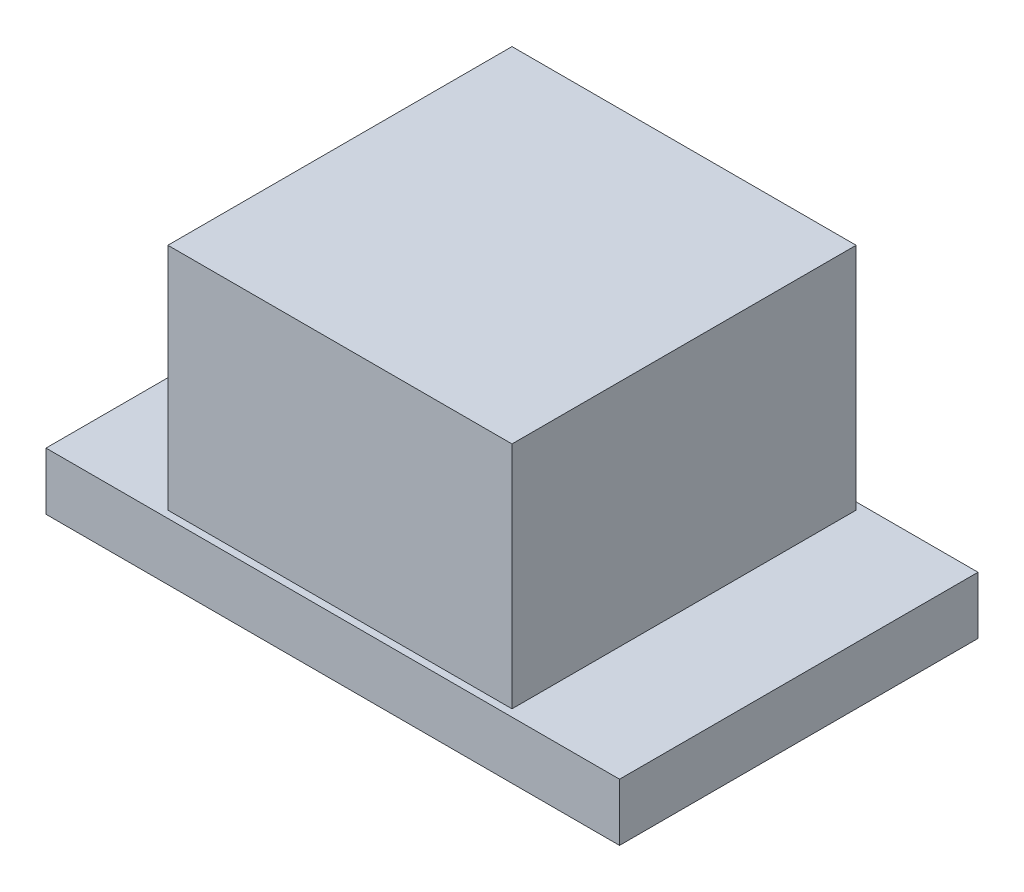
ISO-10303-21;
HEADER;
FILE_DESCRIPTION(('STEP AP214'),'2;1');
FILE_NAME('part.step','',(''),(''),'','','');
FILE_SCHEMA(('AUTOMOTIVE_DESIGN { 1 0 10303 214 1 1 1 1 }'));
ENDSEC;
DATA;
#1=APPLICATION_CONTEXT('core data for automotive mechanical design processes');
#2=APPLICATION_PROTOCOL_DEFINITION('international standard','automotive_design',2000,#1);
#3=PRODUCT_CONTEXT('',#1,'mechanical');
#4=PRODUCT('Part','Part','',(#3));
#5=PRODUCT_RELATED_PRODUCT_CATEGORY('part','',(#4));
#6=PRODUCT_DEFINITION_FORMATION('','',#4);
#7=PRODUCT_DEFINITION_CONTEXT('part definition',#1,'design');
#8=PRODUCT_DEFINITION('design','',#6,#7);
#9=PRODUCT_DEFINITION_SHAPE('','',#8);
#10=(LENGTH_UNIT() NAMED_UNIT(*) SI_UNIT(.MILLI.,.METRE.));
#11=(NAMED_UNIT(*) PLANE_ANGLE_UNIT() SI_UNIT($,.RADIAN.));
#12=(NAMED_UNIT(*) SI_UNIT($,.STERADIAN.) SOLID_ANGLE_UNIT());
#13=UNCERTAINTY_MEASURE_WITH_UNIT(LENGTH_MEASURE(1.E-05),#10,'distance_accuracy_value','');
#14=(GEOMETRIC_REPRESENTATION_CONTEXT(3) GLOBAL_UNCERTAINTY_ASSIGNED_CONTEXT((#13)) GLOBAL_UNIT_ASSIGNED_CONTEXT((#10,
#11,#12)) REPRESENTATION_CONTEXT('',''));
#15=CARTESIAN_POINT('',(0.,0.,0.));
#16=DIRECTION('',(0.,0.,1.));
#17=DIRECTION('',(1.,0.,0.));
#18=AXIS2_PLACEMENT_3D('',#15,#16,#17);
#19=CARTESIAN_POINT('',(-0.6,1.,-0.6));
#20=DIRECTION('',(1.,0.,0.));
#21=DIRECTION('',(0.,0.,-1.));
#22=AXIS2_PLACEMENT_3D('',#19,#20,#21);
#23=PLANE('',#22);
#24=DIRECTION('',(0.,0.,1.));
#25=VECTOR('',#24,1.);
#26=CARTESIAN_POINT('',(-0.6,0.2,-0.6));
#27=LINE('',#26,#25);
#28=CARTESIAN_POINT('',(-0.6,0.2,-0.6));
#29=VERTEX_POINT('',#28);
#30=CARTESIAN_POINT('',(-0.6,0.2,0.6));
#31=VERTEX_POINT('',#30);
#32=EDGE_CURVE('E106',#29,#31,#27,.T.);
#33=ORIENTED_EDGE('',*,*,#32,.T.);
#34=DIRECTION('',(0.,-1.,0.));
#35=VECTOR('',#34,1.);
#36=CARTESIAN_POINT('',(-0.6,1.,0.6));
#37=LINE('',#36,#35);
#38=CARTESIAN_POINT('',(-0.6,1.,0.6));
#39=VERTEX_POINT('',#38);
#40=EDGE_CURVE('E12',#39,#31,#37,.T.);
#41=ORIENTED_EDGE('',*,*,#40,.F.);
#42=DIRECTION('',(0.,0.,1.));
#43=VECTOR('',#42,1.);
#44=CARTESIAN_POINT('',(-0.6,1.,-0.6));
#45=LINE('',#44,#43);
#46=CARTESIAN_POINT('',(-0.6,1.,-0.6));
#47=VERTEX_POINT('',#46);
#48=EDGE_CURVE('E94',#47,#39,#45,.T.);
#49=ORIENTED_EDGE('',*,*,#48,.F.);
#50=DIRECTION('',(0.,-1.,0.));
#51=VECTOR('',#50,1.);
#52=CARTESIAN_POINT('',(-0.6,1.,-0.6));
#53=LINE('',#52,#51);
#54=EDGE_CURVE('E102',#47,#29,#53,.T.);
#55=ORIENTED_EDGE('',*,*,#54,.T.);
#56=EDGE_LOOP('',(#33,#41,#49,#55));
#57=FACE_BOUND('',#56,.T.);
#58=ADVANCED_FACE('F43',(#57),#23,.F.);
#59=CARTESIAN_POINT('',(-0.6,1.,0.6));
#60=DIRECTION('',(0.,0.,-1.));
#61=DIRECTION('',(-1.,0.,0.));
#62=AXIS2_PLACEMENT_3D('',#59,#60,#61);
#63=PLANE('',#62);
#64=DIRECTION('',(1.,0.,0.));
#65=VECTOR('',#64,1.);
#66=CARTESIAN_POINT('',(-0.6,0.2,0.6));
#67=LINE('',#66,#65);
#68=CARTESIAN_POINT('',(0.6,0.2,0.6));
#69=VERTEX_POINT('',#68);
#70=EDGE_CURVE('E98',#31,#69,#67,.T.);
#71=ORIENTED_EDGE('',*,*,#70,.T.);
#72=DIRECTION('',(0.,-1.,0.));
#73=VECTOR('',#72,1.);
#74=CARTESIAN_POINT('',(0.6,1.,0.6));
#75=LINE('',#74,#73);
#76=CARTESIAN_POINT('',(0.6,1.,0.6));
#77=VERTEX_POINT('',#76);
#78=EDGE_CURVE('E51',#77,#69,#75,.T.);
#79=ORIENTED_EDGE('',*,*,#78,.F.);
#80=DIRECTION('',(1.,0.,0.));
#81=VECTOR('',#80,1.);
#82=CARTESIAN_POINT('',(-0.6,1.,0.6));
#83=LINE('',#82,#81);
#84=EDGE_CURVE('E89',#39,#77,#83,.T.);
#85=ORIENTED_EDGE('',*,*,#84,.F.);
#86=ORIENTED_EDGE('',*,*,#40,.T.);
#87=EDGE_LOOP('',(#71,#79,#85,#86));
#88=FACE_BOUND('',#87,.T.);
#89=ADVANCED_FACE('F97',(#88),#63,.F.);
#90=CARTESIAN_POINT('',(0.6,1.,0.6));
#91=DIRECTION('',(-1.,0.,0.));
#92=DIRECTION('',(0.,0.,1.));
#93=AXIS2_PLACEMENT_3D('',#90,#91,#92);
#94=PLANE('',#93);
#95=DIRECTION('',(0.,0.,-1.));
#96=VECTOR('',#95,1.);
#97=CARTESIAN_POINT('',(0.6,0.2,0.6));
#98=LINE('',#97,#96);
#99=CARTESIAN_POINT('',(0.6,0.2,-0.6));
#100=VERTEX_POINT('',#99);
#101=EDGE_CURVE('E76',#69,#100,#98,.T.);
#102=ORIENTED_EDGE('',*,*,#101,.T.);
#103=DIRECTION('',(0.,-1.,0.));
#104=VECTOR('',#103,1.);
#105=CARTESIAN_POINT('',(0.6,1.,-0.6));
#106=LINE('',#105,#104);
#107=CARTESIAN_POINT('',(0.6,1.,-0.6));
#108=VERTEX_POINT('',#107);
#109=EDGE_CURVE('E99',#108,#100,#106,.T.);
#110=ORIENTED_EDGE('',*,*,#109,.F.);
#111=DIRECTION('',(0.,0.,-1.));
#112=VECTOR('',#111,1.);
#113=CARTESIAN_POINT('',(0.6,1.,0.6));
#114=LINE('',#113,#112);
#115=EDGE_CURVE('E92',#77,#108,#114,.T.);
#116=ORIENTED_EDGE('',*,*,#115,.F.);
#117=ORIENTED_EDGE('',*,*,#78,.T.);
#118=EDGE_LOOP('',(#102,#110,#116,#117));
#119=FACE_BOUND('',#118,.T.);
#120=ADVANCED_FACE('F100',(#119),#94,.F.);
#121=CARTESIAN_POINT('',(0.6,1.,-0.6));
#122=DIRECTION('',(0.,0.,1.));
#123=DIRECTION('',(1.,0.,0.));
#124=AXIS2_PLACEMENT_3D('',#121,#122,#123);
#125=PLANE('',#124);
#126=DIRECTION('',(-1.,0.,0.));
#127=VECTOR('',#126,1.);
#128=CARTESIAN_POINT('',(0.6,0.2,-0.6));
#129=LINE('',#128,#127);
#130=EDGE_CURVE('E82',#100,#29,#129,.T.);
#131=ORIENTED_EDGE('',*,*,#130,.T.);
#132=ORIENTED_EDGE('',*,*,#54,.F.);
#133=DIRECTION('',(-1.,0.,0.));
#134=VECTOR('',#133,1.);
#135=CARTESIAN_POINT('',(0.6,1.,-0.6));
#136=LINE('',#135,#134);
#137=EDGE_CURVE('E59',#108,#47,#136,.T.);
#138=ORIENTED_EDGE('',*,*,#137,.F.);
#139=ORIENTED_EDGE('',*,*,#109,.T.);
#140=EDGE_LOOP('',(#131,#132,#138,#139));
#141=FACE_BOUND('',#140,.T.);
#142=ADVANCED_FACE('F113',(#141),#125,.F.);
#143=CARTESIAN_POINT('',(0.,1.,0.));
#144=DIRECTION('',(0.,1.,0.));
#145=DIRECTION('',(0.,0.,1.));
#146=AXIS2_PLACEMENT_3D('',#143,#144,#145);
#147=PLANE('',#146);
#148=ORIENTED_EDGE('',*,*,#48,.T.);
#149=ORIENTED_EDGE('',*,*,#84,.T.);
#150=ORIENTED_EDGE('',*,*,#115,.T.);
#151=ORIENTED_EDGE('',*,*,#137,.T.);
#152=EDGE_LOOP('',(#148,#149,#150,#151));
#153=FACE_BOUND('',#152,.T.);
#154=ADVANCED_FACE('F90',(#153),#147,.T.);
#155=CARTESIAN_POINT('',(0.,0.2,0.));
#156=DIRECTION('',(0.,1.,0.));
#157=DIRECTION('',(0.,0.,1.));
#158=AXIS2_PLACEMENT_3D('',#155,#156,#157);
#159=PLANE('',#158);
#160=ORIENTED_EDGE('',*,*,#32,.F.);
#161=ORIENTED_EDGE('',*,*,#130,.F.);
#162=ORIENTED_EDGE('',*,*,#101,.F.);
#163=ORIENTED_EDGE('',*,*,#70,.F.);
#164=EDGE_LOOP('',(#160,#161,#162,#163));
#165=FACE_BOUND('',#164,.T.);
#166=ADVANCED_FACE('F116',(#165),#159,.F.);
#167=CLOSED_SHELL('',(#58,#89,#120,#142,#154,#166));
#168=MANIFOLD_SOLID_BREP('B2',#167);
#169=CARTESIAN_POINT('',(-0.6,0.2,0.6));
#170=DIRECTION('',(0.,0.,-1.));
#171=DIRECTION('',(-1.,0.,0.));
#172=AXIS2_PLACEMENT_3D('',#169,#170,#171);
#173=PLANE('',#172);
#174=DIRECTION('',(1.,0.,0.));
#175=VECTOR('',#174,1.);
#176=CARTESIAN_POINT('',(-0.6,0.19,0.6));
#177=LINE('',#176,#175);
#178=CARTESIAN_POINT('',(-0.6,0.19,0.6));
#179=VERTEX_POINT('',#178);
#180=CARTESIAN_POINT('',(0.6,0.19,0.6));
#181=VERTEX_POINT('',#180);
#182=EDGE_CURVE('E239',#179,#181,#177,.T.);
#183=ORIENTED_EDGE('',*,*,#182,.T.);
#184=DIRECTION('',(0.,-1.,0.));
#185=VECTOR('',#184,1.);
#186=CARTESIAN_POINT('',(0.6,0.2,0.6));
#187=LINE('',#186,#185);
#188=CARTESIAN_POINT('',(0.6,0.2,0.6));
#189=VERTEX_POINT('',#188);
#190=EDGE_CURVE('E41',#189,#181,#187,.T.);
#191=ORIENTED_EDGE('',*,*,#190,.F.);
#192=DIRECTION('',(1.,0.,0.));
#193=VECTOR('',#192,1.);
#194=CARTESIAN_POINT('',(-0.6,0.2,0.6));
#195=LINE('',#194,#193);
#196=CARTESIAN_POINT('',(-0.6,0.2,0.6));
#197=VERTEX_POINT('',#196);
#198=EDGE_CURVE('E227',#197,#189,#195,.T.);
#199=ORIENTED_EDGE('',*,*,#198,.F.);
#200=DIRECTION('',(0.,-1.,0.));
#201=VECTOR('',#200,1.);
#202=CARTESIAN_POINT('',(-0.6,0.2,0.6));
#203=LINE('',#202,#201);
#204=EDGE_CURVE('E235',#197,#179,#203,.T.);
#205=ORIENTED_EDGE('',*,*,#204,.T.);
#206=EDGE_LOOP('',(#183,#191,#199,#205));
#207=FACE_BOUND('',#206,.T.);
#208=ADVANCED_FACE('F176',(#207),#173,.F.);
#209=CARTESIAN_POINT('',(0.6,0.2,0.6));
#210=DIRECTION('',(-1.,0.,0.));
#211=DIRECTION('',(0.,0.,1.));
#212=AXIS2_PLACEMENT_3D('',#209,#210,#211);
#213=PLANE('',#212);
#214=DIRECTION('',(0.,0.,-1.));
#215=VECTOR('',#214,1.);
#216=CARTESIAN_POINT('',(0.6,0.19,0.6));
#217=LINE('',#216,#215);
#218=CARTESIAN_POINT('',(0.6,0.19,-0.6));
#219=VERTEX_POINT('',#218);
#220=EDGE_CURVE('E231',#181,#219,#217,.T.);
#221=ORIENTED_EDGE('',*,*,#220,.T.);
#222=DIRECTION('',(0.,-1.,0.));
#223=VECTOR('',#222,1.);
#224=CARTESIAN_POINT('',(0.6,0.2,-0.6));
#225=LINE('',#224,#223);
#226=CARTESIAN_POINT('',(0.6,0.2,-0.6));
#227=VERTEX_POINT('',#226);
#228=EDGE_CURVE('E184',#227,#219,#225,.T.);
#229=ORIENTED_EDGE('',*,*,#228,.F.);
#230=DIRECTION('',(0.,0.,-1.));
#231=VECTOR('',#230,1.);
#232=CARTESIAN_POINT('',(0.6,0.2,0.6));
#233=LINE('',#232,#231);
#234=EDGE_CURVE('E222',#189,#227,#233,.T.);
#235=ORIENTED_EDGE('',*,*,#234,.F.);
#236=ORIENTED_EDGE('',*,*,#190,.T.);
#237=EDGE_LOOP('',(#221,#229,#235,#236));
#238=FACE_BOUND('',#237,.T.);
#239=ADVANCED_FACE('F230',(#238),#213,.F.);
#240=CARTESIAN_POINT('',(0.6,0.2,-0.6));
#241=DIRECTION('',(0.,0.,1.));
#242=DIRECTION('',(1.,0.,0.));
#243=AXIS2_PLACEMENT_3D('',#240,#241,#242);
#244=PLANE('',#243);
#245=DIRECTION('',(-1.,0.,0.));
#246=VECTOR('',#245,1.);
#247=CARTESIAN_POINT('',(0.6,0.19,-0.6));
#248=LINE('',#247,#246);
#249=CARTESIAN_POINT('',(-0.6,0.19,-0.6));
#250=VERTEX_POINT('',#249);
#251=EDGE_CURVE('E209',#219,#250,#248,.T.);
#252=ORIENTED_EDGE('',*,*,#251,.T.);
#253=DIRECTION('',(0.,-1.,0.));
#254=VECTOR('',#253,1.);
#255=CARTESIAN_POINT('',(-0.6,0.2,-0.6));
#256=LINE('',#255,#254);
#257=CARTESIAN_POINT('',(-0.6,0.2,-0.6));
#258=VERTEX_POINT('',#257);
#259=EDGE_CURVE('E232',#258,#250,#256,.T.);
#260=ORIENTED_EDGE('',*,*,#259,.F.);
#261=DIRECTION('',(-1.,0.,0.));
#262=VECTOR('',#261,1.);
#263=CARTESIAN_POINT('',(0.6,0.2,-0.6));
#264=LINE('',#263,#262);
#265=EDGE_CURVE('E225',#227,#258,#264,.T.);
#266=ORIENTED_EDGE('',*,*,#265,.F.);
#267=ORIENTED_EDGE('',*,*,#228,.T.);
#268=EDGE_LOOP('',(#252,#260,#266,#267));
#269=FACE_BOUND('',#268,.T.);
#270=ADVANCED_FACE('F233',(#269),#244,.F.);
#271=CARTESIAN_POINT('',(-0.6,0.2,-0.6));
#272=DIRECTION('',(1.,0.,0.));
#273=DIRECTION('',(0.,0.,-1.));
#274=AXIS2_PLACEMENT_3D('',#271,#272,#273);
#275=PLANE('',#274);
#276=DIRECTION('',(0.,0.,1.));
#277=VECTOR('',#276,1.);
#278=CARTESIAN_POINT('',(-0.6,0.19,-0.6));
#279=LINE('',#278,#277);
#280=EDGE_CURVE('E215',#250,#179,#279,.T.);
#281=ORIENTED_EDGE('',*,*,#280,.T.);
#282=ORIENTED_EDGE('',*,*,#204,.F.);
#283=DIRECTION('',(0.,0.,1.));
#284=VECTOR('',#283,1.);
#285=CARTESIAN_POINT('',(-0.6,0.2,-0.6));
#286=LINE('',#285,#284);
#287=EDGE_CURVE('E192',#258,#197,#286,.T.);
#288=ORIENTED_EDGE('',*,*,#287,.F.);
#289=ORIENTED_EDGE('',*,*,#259,.T.);
#290=EDGE_LOOP('',(#281,#282,#288,#289));
#291=FACE_BOUND('',#290,.T.);
#292=ADVANCED_FACE('F246',(#291),#275,.F.);
#293=CARTESIAN_POINT('',(0.,0.2,0.));
#294=DIRECTION('',(0.,1.,0.));
#295=DIRECTION('',(0.,0.,1.));
#296=AXIS2_PLACEMENT_3D('',#293,#294,#295);
#297=PLANE('',#296);
#298=ORIENTED_EDGE('',*,*,#198,.T.);
#299=ORIENTED_EDGE('',*,*,#234,.T.);
#300=ORIENTED_EDGE('',*,*,#265,.T.);
#301=ORIENTED_EDGE('',*,*,#287,.T.);
#302=EDGE_LOOP('',(#298,#299,#300,#301));
#303=FACE_BOUND('',#302,.T.);
#304=ADVANCED_FACE('F223',(#303),#297,.T.);
#305=CARTESIAN_POINT('',(0.,0.19,0.));
#306=DIRECTION('',(0.,1.,0.));
#307=DIRECTION('',(0.,0.,1.));
#308=AXIS2_PLACEMENT_3D('',#305,#306,#307);
#309=PLANE('',#308);
#310=ORIENTED_EDGE('',*,*,#182,.F.);
#311=ORIENTED_EDGE('',*,*,#280,.F.);
#312=ORIENTED_EDGE('',*,*,#251,.F.);
#313=ORIENTED_EDGE('',*,*,#220,.F.);
#314=EDGE_LOOP('',(#310,#311,#312,#313));
#315=FACE_BOUND('',#314,.T.);
#316=ADVANCED_FACE('F249',(#315),#309,.F.);
#317=CLOSED_SHELL('',(#208,#239,#270,#292,#304,#316));
#318=MANIFOLD_SOLID_BREP('B6',#317);
#319=CARTESIAN_POINT('',(0.,0.2,0.));
#320=DIRECTION('',(0.,1.,0.));
#321=DIRECTION('',(0.,0.,1.));
#322=AXIS2_PLACEMENT_3D('',#319,#320,#321);
#323=PLANE('',#322);
#324=DIRECTION('',(0.,0.,-1.));
#325=VECTOR('',#324,1.);
#326=CARTESIAN_POINT('',(0.6,0.2,-0.6));
#327=LINE('',#326,#325);
#328=CARTESIAN_POINT('',(0.6,0.2,0.6));
#329=VERTEX_POINT('',#328);
#330=CARTESIAN_POINT('',(0.6,0.2,-0.6));
#331=VERTEX_POINT('',#330);
#332=EDGE_CURVE('E316',#329,#331,#327,.T.);
#333=ORIENTED_EDGE('',*,*,#332,.F.);
#334=DIRECTION('',(1.,0.,0.));
#335=VECTOR('',#334,1.);
#336=CARTESIAN_POINT('',(-0.6,0.2,0.6));
#337=LINE('',#336,#335);
#338=CARTESIAN_POINT('',(-0.6,0.2,0.6));
#339=VERTEX_POINT('',#338);
#340=EDGE_CURVE('E409',#339,#329,#337,.T.);
#341=ORIENTED_EDGE('',*,*,#340,.F.);
#342=DIRECTION('',(0.,0.,1.));
#343=VECTOR('',#342,1.);
#344=CARTESIAN_POINT('',(-0.6,0.2,-0.6));
#345=LINE('',#344,#343);
#346=CARTESIAN_POINT('',(-0.6,0.2,-0.6));
#347=VERTEX_POINT('',#346);
#348=EDGE_CURVE('E406',#347,#339,#345,.T.);
#349=ORIENTED_EDGE('',*,*,#348,.F.);
#350=DIRECTION('',(-1.,0.,0.));
#351=VECTOR('',#350,1.);
#352=CARTESIAN_POINT('',(-0.6,0.2,-0.6));
#353=LINE('',#352,#351);
#354=EDGE_CURVE('E407',#331,#347,#353,.T.);
#355=ORIENTED_EDGE('',*,*,#354,.F.);
#356=EDGE_LOOP('',(#333,#341,#349,#355));
#357=FACE_BOUND('',#356,.T.);
#358=DIRECTION('',(0.,0.,-1.));
#359=VECTOR('',#358,1.);
#360=CARTESIAN_POINT('',(1.,0.2,-0.625));
#361=LINE('',#360,#359);
#362=CARTESIAN_POINT('',(1.,0.2,0.625));
#363=VERTEX_POINT('',#362);
#364=CARTESIAN_POINT('',(1.,0.2,-0.625));
#365=VERTEX_POINT('',#364);
#366=EDGE_CURVE('E380',#363,#365,#361,.T.);
#367=ORIENTED_EDGE('',*,*,#366,.T.);
#368=DIRECTION('',(-1.,0.,0.));
#369=VECTOR('',#368,1.);
#370=CARTESIAN_POINT('',(-1.,0.2,-0.625));
#371=LINE('',#370,#369);
#372=CARTESIAN_POINT('',(-1.,0.2,-0.625));
#373=VERTEX_POINT('',#372);
#374=EDGE_CURVE('E374',#365,#373,#371,.T.);
#375=ORIENTED_EDGE('',*,*,#374,.T.);
#376=DIRECTION('',(0.,0.,1.));
#377=VECTOR('',#376,1.);
#378=CARTESIAN_POINT('',(-1.,0.2,-0.625));
#379=LINE('',#378,#377);
#380=CARTESIAN_POINT('',(-1.,0.2,0.625));
#381=VERTEX_POINT('',#380);
#382=EDGE_CURVE('E377',#373,#381,#379,.T.);
#383=ORIENTED_EDGE('',*,*,#382,.T.);
#384=DIRECTION('',(1.,0.,0.));
#385=VECTOR('',#384,1.);
#386=CARTESIAN_POINT('',(-1.,0.2,0.625));
#387=LINE('',#386,#385);
#388=EDGE_CURVE('E396',#381,#363,#387,.T.);
#389=ORIENTED_EDGE('',*,*,#388,.T.);
#390=EDGE_LOOP('',(#367,#375,#383,#389));
#391=FACE_BOUND('',#390,.T.);
#392=ADVANCED_FACE('F306',(#357,#391),#323,.T.);
#393=CARTESIAN_POINT('',(1.,0.2,-0.625));
#394=DIRECTION('',(-1.,0.,0.));
#395=DIRECTION('',(0.,0.,1.));
#396=AXIS2_PLACEMENT_3D('',#393,#394,#395);
#397=PLANE('',#396);
#398=DIRECTION('',(0.,0.,-1.));
#399=VECTOR('',#398,1.);
#400=CARTESIAN_POINT('',(1.,0.,-0.625));
#401=LINE('',#400,#399);
#402=CARTESIAN_POINT('',(1.,0.,0.625));
#403=VERTEX_POINT('',#402);
#404=CARTESIAN_POINT('',(1.,0.,-0.625));
#405=VERTEX_POINT('',#404);
#406=EDGE_CURVE('E398',#403,#405,#401,.T.);
#407=ORIENTED_EDGE('',*,*,#406,.T.);
#408=DIRECTION('',(0.,-1.,0.));
#409=VECTOR('',#408,1.);
#410=CARTESIAN_POINT('',(1.,0.2,-0.625));
#411=LINE('',#410,#409);
#412=EDGE_CURVE('E436',#365,#405,#411,.T.);
#413=ORIENTED_EDGE('',*,*,#412,.F.);
#414=ORIENTED_EDGE('',*,*,#366,.F.);
#415=DIRECTION('',(0.,-1.,0.));
#416=VECTOR('',#415,1.);
#417=CARTESIAN_POINT('',(1.,0.2,0.625));
#418=LINE('',#417,#416);
#419=EDGE_CURVE('E432',#363,#403,#418,.T.);
#420=ORIENTED_EDGE('',*,*,#419,.T.);
#421=EDGE_LOOP('',(#407,#413,#414,#420));
#422=FACE_BOUND('',#421,.T.);
#423=ADVANCED_FACE('F439',(#422),#397,.F.);
#424=CARTESIAN_POINT('',(-1.,0.2,-0.625));
#425=DIRECTION('',(0.,0.,1.));
#426=DIRECTION('',(1.,0.,0.));
#427=AXIS2_PLACEMENT_3D('',#424,#425,#426);
#428=PLANE('',#427);
#429=DIRECTION('',(-1.,0.,0.));
#430=VECTOR('',#429,1.);
#431=CARTESIAN_POINT('',(-1.,0.,-0.625));
#432=LINE('',#431,#430);
#433=CARTESIAN_POINT('',(-1.,0.,-0.625));
#434=VERTEX_POINT('',#433);
#435=EDGE_CURVE('E355',#405,#434,#432,.T.);
#436=ORIENTED_EDGE('',*,*,#435,.T.);
#437=DIRECTION('',(0.,-1.,0.));
#438=VECTOR('',#437,1.);
#439=CARTESIAN_POINT('',(-1.,0.2,-0.625));
#440=LINE('',#439,#438);
#441=EDGE_CURVE('E385',#373,#434,#440,.T.);
#442=ORIENTED_EDGE('',*,*,#441,.F.);
#443=ORIENTED_EDGE('',*,*,#374,.F.);
#444=ORIENTED_EDGE('',*,*,#412,.T.);
#445=EDGE_LOOP('',(#436,#442,#443,#444));
#446=FACE_BOUND('',#445,.T.);
#447=ADVANCED_FACE('F386',(#446),#428,.F.);
#448=CARTESIAN_POINT('',(-1.,0.2,-0.625));
#449=DIRECTION('',(1.,0.,0.));
#450=DIRECTION('',(0.,0.,-1.));
#451=AXIS2_PLACEMENT_3D('',#448,#449,#450);
#452=PLANE('',#451);
#453=DIRECTION('',(0.,0.,1.));
#454=VECTOR('',#453,1.);
#455=CARTESIAN_POINT('',(-1.,0.,-0.625));
#456=LINE('',#455,#454);
#457=CARTESIAN_POINT('',(-1.,0.,0.625));
#458=VERTEX_POINT('',#457);
#459=EDGE_CURVE('E390',#434,#458,#456,.T.);
#460=ORIENTED_EDGE('',*,*,#459,.T.);
#461=DIRECTION('',(0.,-1.,0.));
#462=VECTOR('',#461,1.);
#463=CARTESIAN_POINT('',(-1.,0.2,0.625));
#464=LINE('',#463,#462);
#465=EDGE_CURVE('E394',#381,#458,#464,.T.);
#466=ORIENTED_EDGE('',*,*,#465,.F.);
#467=ORIENTED_EDGE('',*,*,#382,.F.);
#468=ORIENTED_EDGE('',*,*,#441,.T.);
#469=EDGE_LOOP('',(#460,#466,#467,#468));
#470=FACE_BOUND('',#469,.T.);
#471=ADVANCED_FACE('F392',(#470),#452,.F.);
#472=CARTESIAN_POINT('',(-1.,0.2,0.625));
#473=DIRECTION('',(0.,0.,-1.));
#474=DIRECTION('',(-1.,0.,0.));
#475=AXIS2_PLACEMENT_3D('',#472,#473,#474);
#476=PLANE('',#475);
#477=DIRECTION('',(1.,0.,0.));
#478=VECTOR('',#477,1.);
#479=CARTESIAN_POINT('',(-1.,0.,0.625));
#480=LINE('',#479,#478);
#481=EDGE_CURVE('E389',#458,#403,#480,.T.);
#482=ORIENTED_EDGE('',*,*,#481,.T.);
#483=ORIENTED_EDGE('',*,*,#419,.F.);
#484=ORIENTED_EDGE('',*,*,#388,.F.);
#485=ORIENTED_EDGE('',*,*,#465,.T.);
#486=EDGE_LOOP('',(#482,#483,#484,#485));
#487=FACE_BOUND('',#486,.T.);
#488=ADVANCED_FACE('F442',(#487),#476,.F.);
#489=CARTESIAN_POINT('',(0.,0.,0.));
#490=DIRECTION('',(0.,1.,0.));
#491=DIRECTION('',(0.,0.,1.));
#492=AXIS2_PLACEMENT_3D('',#489,#490,#491);
#493=PLANE('',#492);
#494=ORIENTED_EDGE('',*,*,#406,.F.);
#495=ORIENTED_EDGE('',*,*,#481,.F.);
#496=ORIENTED_EDGE('',*,*,#459,.F.);
#497=ORIENTED_EDGE('',*,*,#435,.F.);
#498=EDGE_LOOP('',(#494,#495,#496,#497));
#499=FACE_BOUND('',#498,.T.);
#500=ADVANCED_FACE('F441',(#499),#493,.F.);
#501=CARTESIAN_POINT('',(0.,0.19,0.));
#502=DIRECTION('',(0.,1.,0.));
#503=DIRECTION('',(0.,0.,1.));
#504=AXIS2_PLACEMENT_3D('',#501,#502,#503);
#505=PLANE('',#504);
#506=DIRECTION('',(0.,0.,-1.));
#507=VECTOR('',#506,1.);
#508=CARTESIAN_POINT('',(0.6,0.19,-0.6));
#509=LINE('',#508,#507);
#510=CARTESIAN_POINT('',(0.6,0.19,0.6));
#511=VERTEX_POINT('',#510);
#512=CARTESIAN_POINT('',(0.6,0.19,-0.6));
#513=VERTEX_POINT('',#512);
#514=EDGE_CURVE('E310',#511,#513,#509,.T.);
#515=ORIENTED_EDGE('',*,*,#514,.T.);
#516=DIRECTION('',(-1.,0.,0.));
#517=VECTOR('',#516,1.);
#518=CARTESIAN_POINT('',(-0.6,0.19,-0.6));
#519=LINE('',#518,#517);
#520=CARTESIAN_POINT('',(-0.6,0.19,-0.6));
#521=VERTEX_POINT('',#520);
#522=EDGE_CURVE('E422',#513,#521,#519,.T.);
#523=ORIENTED_EDGE('',*,*,#522,.T.);
#524=DIRECTION('',(0.,0.,1.));
#525=VECTOR('',#524,1.);
#526=CARTESIAN_POINT('',(-0.6,0.19,-0.6));
#527=LINE('',#526,#525);
#528=CARTESIAN_POINT('',(-0.6,0.19,0.6));
#529=VERTEX_POINT('',#528);
#530=EDGE_CURVE('E420',#521,#529,#527,.T.);
#531=ORIENTED_EDGE('',*,*,#530,.T.);
#532=DIRECTION('',(1.,0.,0.));
#533=VECTOR('',#532,1.);
#534=CARTESIAN_POINT('',(-0.6,0.19,0.6));
#535=LINE('',#534,#533);
#536=EDGE_CURVE('E416',#529,#511,#535,.T.);
#537=ORIENTED_EDGE('',*,*,#536,.T.);
#538=EDGE_LOOP('',(#515,#523,#531,#537));
#539=FACE_BOUND('',#538,.T.);
#540=ADVANCED_FACE('F308',(#539),#505,.T.);
#541=CARTESIAN_POINT('',(-0.6,0.19,-0.6));
#542=DIRECTION('',(0.,0.,-1.));
#543=DIRECTION('',(-1.,0.,0.));
#544=AXIS2_PLACEMENT_3D('',#541,#542,#543);
#545=PLANE('',#544);
#546=ORIENTED_EDGE('',*,*,#354,.T.);
#547=DIRECTION('',(0.,1.,0.));
#548=VECTOR('',#547,1.);
#549=CARTESIAN_POINT('',(-0.6,0.19,-0.6));
#550=LINE('',#549,#548);
#551=EDGE_CURVE('E346',#521,#347,#550,.T.);
#552=ORIENTED_EDGE('',*,*,#551,.F.);
#553=ORIENTED_EDGE('',*,*,#522,.F.);
#554=DIRECTION('',(0.,1.,0.));
#555=VECTOR('',#554,1.);
#556=CARTESIAN_POINT('',(0.6,0.19,-0.6));
#557=LINE('',#556,#555);
#558=EDGE_CURVE('E403',#513,#331,#557,.T.);
#559=ORIENTED_EDGE('',*,*,#558,.T.);
#560=EDGE_LOOP('',(#546,#552,#553,#559));
#561=FACE_BOUND('',#560,.T.);
#562=ADVANCED_FACE('F464',(#561),#545,.F.);
#563=CARTESIAN_POINT('',(-0.6,0.19,-0.6));
#564=DIRECTION('',(-1.,0.,0.));
#565=DIRECTION('',(0.,0.,1.));
#566=AXIS2_PLACEMENT_3D('',#563,#564,#565);
#567=PLANE('',#566);
#568=ORIENTED_EDGE('',*,*,#348,.T.);
#569=DIRECTION('',(0.,1.,0.));
#570=VECTOR('',#569,1.);
#571=CARTESIAN_POINT('',(-0.6,0.19,0.6));
#572=LINE('',#571,#570);
#573=EDGE_CURVE('E410',#529,#339,#572,.T.);
#574=ORIENTED_EDGE('',*,*,#573,.F.);
#575=ORIENTED_EDGE('',*,*,#530,.F.);
#576=ORIENTED_EDGE('',*,*,#551,.T.);
#577=EDGE_LOOP('',(#568,#574,#575,#576));
#578=FACE_BOUND('',#577,.T.);
#579=ADVANCED_FACE('F467',(#578),#567,.F.);
#580=CARTESIAN_POINT('',(-0.6,0.19,0.6));
#581=DIRECTION('',(0.,0.,1.));
#582=DIRECTION('',(1.,0.,0.));
#583=AXIS2_PLACEMENT_3D('',#580,#581,#582);
#584=PLANE('',#583);
#585=ORIENTED_EDGE('',*,*,#340,.T.);
#586=DIRECTION('',(0.,1.,0.));
#587=VECTOR('',#586,1.);
#588=CARTESIAN_POINT('',(0.6,0.19,0.6));
#589=LINE('',#588,#587);
#590=EDGE_CURVE('E174',#511,#329,#589,.T.);
#591=ORIENTED_EDGE('',*,*,#590,.F.);
#592=ORIENTED_EDGE('',*,*,#536,.F.);
#593=ORIENTED_EDGE('',*,*,#573,.T.);
#594=EDGE_LOOP('',(#585,#591,#592,#593));
#595=FACE_BOUND('',#594,.T.);
#596=ADVANCED_FACE('F463',(#595),#584,.F.);
#597=CARTESIAN_POINT('',(0.6,0.19,-0.6));
#598=DIRECTION('',(1.,0.,0.));
#599=DIRECTION('',(0.,0.,-1.));
#600=AXIS2_PLACEMENT_3D('',#597,#598,#599);
#601=PLANE('',#600);
#602=ORIENTED_EDGE('',*,*,#332,.T.);
#603=ORIENTED_EDGE('',*,*,#558,.F.);
#604=ORIENTED_EDGE('',*,*,#514,.F.);
#605=ORIENTED_EDGE('',*,*,#590,.T.);
#606=EDGE_LOOP('',(#602,#603,#604,#605));
#607=FACE_BOUND('',#606,.T.);
#608=ADVANCED_FACE('F460',(#607),#601,.F.);
#609=CLOSED_SHELL('',(#392,#423,#447,#471,#488,#500,#540,#562,#579,#596,#608));
#610=MANIFOLD_SOLID_BREP('B35',#609);
#611=CARTESIAN_POINT('',(0.,0.3,0.));
#612=DIRECTION('',(0.,1.,0.));
#613=DIRECTION('',(0.,0.,1.));
#614=AXIS2_PLACEMENT_3D('',#611,#612,#613);
#615=PLANE('',#614);
#616=CARTESIAN_POINT('',(0.,0.3,0.));
#617=DIRECTION('',(0.,1.,0.));
#618=DIRECTION('',(0.,0.,1.));
#619=AXIS2_PLACEMENT_3D('',#616,#617,#618);
#620=CIRCLE('',#619,0.1);
#621=CARTESIAN_POINT('',(0.,0.3,0.1));
#622=VERTEX_POINT('',#621);
#623=EDGE_CURVE('E305',#622,#622,#620,.T.);
#624=ORIENTED_EDGE('',*,*,#623,.T.);
#625=EDGE_LOOP('',(#624));
#626=FACE_BOUND('',#625,.T.);
#627=ADVANCED_FACE('F547',(#626),#615,.T.);
#628=CARTESIAN_POINT('',(0.,0.3,0.));
#629=DIRECTION('',(0.,-1.,0.));
#630=DIRECTION('',(0.,0.,-1.));
#631=AXIS2_PLACEMENT_3D('',#628,#629,#630);
#632=CYLINDRICAL_SURFACE('',#631,0.1);
#633=CARTESIAN_POINT('',(0.,0.2,0.));
#634=DIRECTION('',(0.,1.,0.));
#635=DIRECTION('',(0.,0.,1.));
#636=AXIS2_PLACEMENT_3D('',#633,#634,#635);
#637=CIRCLE('',#636,0.1);
#638=CARTESIAN_POINT('',(0.,0.2,0.1));
#639=VERTEX_POINT('',#638);
#640=EDGE_CURVE('E554',#639,#639,#637,.T.);
#641=ORIENTED_EDGE('',*,*,#640,.T.);
#642=EDGE_LOOP('',(#641));
#643=FACE_BOUND('',#642,.T.);
#644=ORIENTED_EDGE('',*,*,#623,.F.);
#645=EDGE_LOOP('',(#644));
#646=FACE_BOUND('',#645,.T.);
#647=ADVANCED_FACE('F549',(#643,#646),#632,.T.);
#648=CARTESIAN_POINT('',(0.,0.2,0.));
#649=DIRECTION('',(0.,1.,0.));
#650=DIRECTION('',(0.,0.,1.));
#651=AXIS2_PLACEMENT_3D('',#648,#649,#650);
#652=PLANE('',#651);
#653=ORIENTED_EDGE('',*,*,#640,.F.);
#654=EDGE_LOOP('',(#653));
#655=FACE_BOUND('',#654,.T.);
#656=ADVANCED_FACE('F562',(#655),#652,.F.);
#657=CLOSED_SHELL('',(#627,#647,#656));
#658=MANIFOLD_SOLID_BREP('B168',#657);
#659=ADVANCED_BREP_SHAPE_REPRESENTATION('',(#18,#168,#318,#610,#658),#14);
#660=SHAPE_DEFINITION_REPRESENTATION(#9,#659);
ENDSEC;
END-ISO-10303-21;
